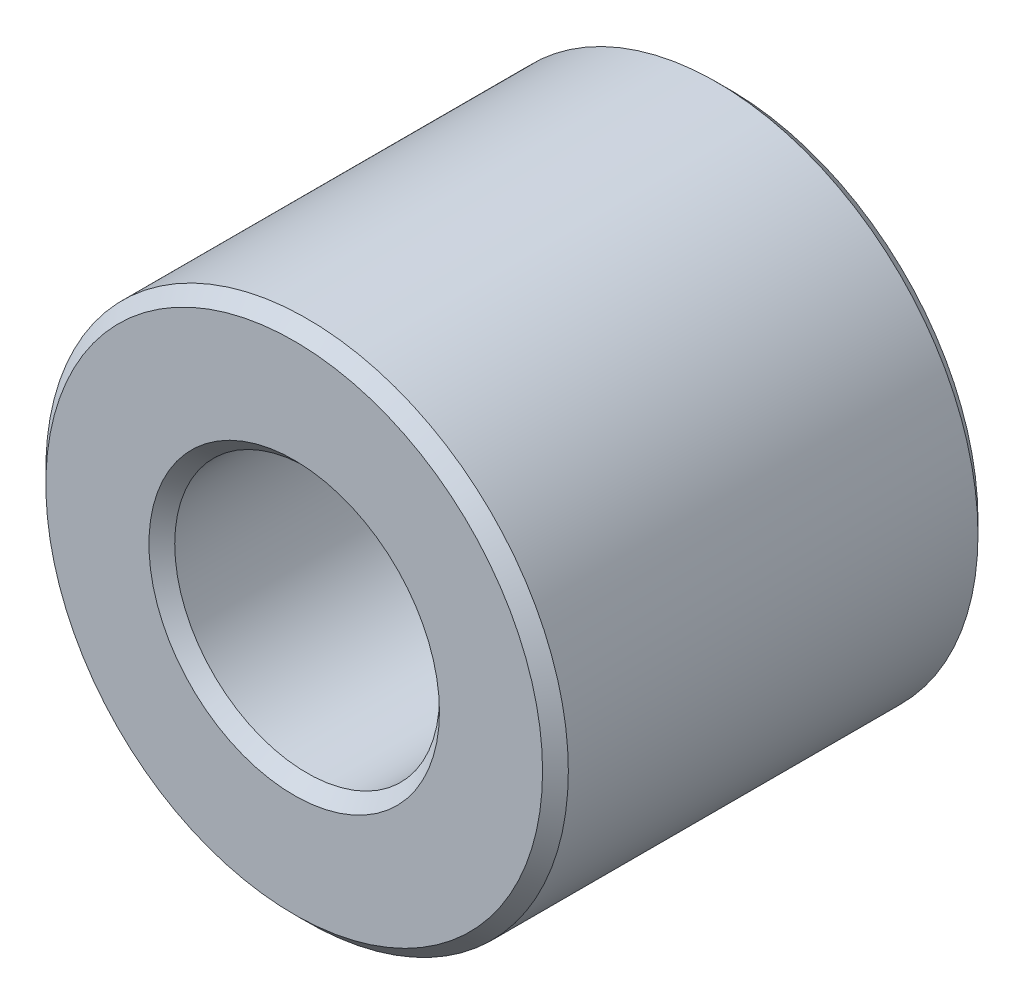
ISO-10303-21;
HEADER;
FILE_DESCRIPTION(('STEP AP214'),'2;1');
FILE_NAME('part.step','',(''),(''),'','','');
FILE_SCHEMA(('AUTOMOTIVE_DESIGN { 1 0 10303 214 1 1 1 1 }'));
ENDSEC;
DATA;
#1=APPLICATION_CONTEXT('core data for automotive mechanical design processes');
#2=APPLICATION_PROTOCOL_DEFINITION('international standard','automotive_design',2000,#1);
#3=PRODUCT_CONTEXT('',#1,'mechanical');
#4=PRODUCT('Part','Part','',(#3));
#5=PRODUCT_RELATED_PRODUCT_CATEGORY('part','',(#4));
#6=PRODUCT_DEFINITION_FORMATION('','',#4);
#7=PRODUCT_DEFINITION_CONTEXT('part definition',#1,'design');
#8=PRODUCT_DEFINITION('design','',#6,#7);
#9=PRODUCT_DEFINITION_SHAPE('','',#8);
#10=(LENGTH_UNIT() NAMED_UNIT(*) SI_UNIT(.MILLI.,.METRE.));
#11=(NAMED_UNIT(*) PLANE_ANGLE_UNIT() SI_UNIT($,.RADIAN.));
#12=(NAMED_UNIT(*) SI_UNIT($,.STERADIAN.) SOLID_ANGLE_UNIT());
#13=UNCERTAINTY_MEASURE_WITH_UNIT(LENGTH_MEASURE(1.E-05),#10,'distance_accuracy_value','');
#14=(GEOMETRIC_REPRESENTATION_CONTEXT(3) GLOBAL_UNCERTAINTY_ASSIGNED_CONTEXT((#13)) GLOBAL_UNIT_ASSIGNED_CONTEXT((#10,
#11,#12)) REPRESENTATION_CONTEXT('',''));
#15=CARTESIAN_POINT('',(0.,0.,0.));
#16=DIRECTION('',(0.,0.,1.));
#17=DIRECTION('',(1.,0.,0.));
#18=AXIS2_PLACEMENT_3D('',#15,#16,#17);
#19=CARTESIAN_POINT('',(0.,0.,-7.9375));
#20=DIRECTION('',(0.,0.,1.));
#21=DIRECTION('',(1.,0.,0.));
#22=AXIS2_PLACEMENT_3D('',#19,#20,#21);
#23=CYLINDRICAL_SURFACE('',#22,9.525);
#24=CARTESIAN_POINT('',(0.,0.,7.4676));
#25=DIRECTION('',(0.,0.,1.));
#26=DIRECTION('',(1.,0.,0.));
#27=AXIS2_PLACEMENT_3D('',#24,#25,#26);
#28=CIRCLE('',#27,9.525);
#29=CARTESIAN_POINT('',(9.525,0.,7.4676));
#30=VERTEX_POINT('',#29);
#31=EDGE_CURVE('E50',#30,#30,#28,.F.);
#32=ORIENTED_EDGE('',*,*,#31,.T.);
#33=EDGE_LOOP('',(#32));
#34=FACE_BOUND('',#33,.T.);
#35=CARTESIAN_POINT('',(0.,0.,-7.46759999999999));
#36=DIRECTION('',(0.,0.,1.));
#37=DIRECTION('',(1.,0.,0.));
#38=AXIS2_PLACEMENT_3D('',#35,#36,#37);
#39=CIRCLE('',#38,9.525);
#40=CARTESIAN_POINT('',(9.525,0.,-7.46759999999999));
#41=VERTEX_POINT('',#40);
#42=EDGE_CURVE('E53',#41,#41,#39,.T.);
#43=ORIENTED_EDGE('',*,*,#42,.T.);
#44=EDGE_LOOP('',(#43));
#45=FACE_BOUND('',#44,.T.);
#46=ADVANCED_FACE('F30',(#34,#45),#23,.T.);
#47=CARTESIAN_POINT('',(0.,0.,-7.9375));
#48=DIRECTION('',(0.,0.,1.));
#49=DIRECTION('',(1.,0.,0.));
#50=AXIS2_PLACEMENT_3D('',#47,#48,#49);
#51=PLANE('',#50);
#52=CARTESIAN_POINT('',(0.,0.,-7.9375));
#53=DIRECTION('',(0.,0.,1.));
#54=DIRECTION('',(1.,0.,0.));
#55=AXIS2_PLACEMENT_3D('',#52,#53,#54);
#56=CIRCLE('',#55,9.05509999999999);
#57=CARTESIAN_POINT('',(9.05509999999999,0.,-7.9375));
#58=VERTEX_POINT('',#57);
#59=EDGE_CURVE('E41',#58,#58,#56,.F.);
#60=ORIENTED_EDGE('',*,*,#59,.T.);
#61=EDGE_LOOP('',(#60));
#62=FACE_BOUND('',#61,.T.);
#63=CARTESIAN_POINT('',(0.,0.,-7.9375));
#64=DIRECTION('',(0.,0.,1.));
#65=DIRECTION('',(1.,0.,0.));
#66=AXIS2_PLACEMENT_3D('',#63,#64,#65);
#67=CIRCLE('',#66,5.2959);
#68=CARTESIAN_POINT('',(5.2959,0.,-7.9375));
#69=VERTEX_POINT('',#68);
#70=EDGE_CURVE('E45',#69,#69,#67,.T.);
#71=ORIENTED_EDGE('',*,*,#70,.T.);
#72=EDGE_LOOP('',(#71));
#73=FACE_BOUND('',#72,.T.);
#74=ADVANCED_FACE('F78',(#62,#73),#51,.F.);
#75=CARTESIAN_POINT('',(0.,0.,-7.9375));
#76=DIRECTION('',(0.,0.,1.));
#77=DIRECTION('',(1.,0.,0.));
#78=AXIS2_PLACEMENT_3D('',#75,#76,#77);
#79=CYLINDRICAL_SURFACE('',#78,4.826);
#80=CARTESIAN_POINT('',(0.,0.,7.46760000000001));
#81=DIRECTION('',(0.,0.,1.));
#82=DIRECTION('',(1.,0.,0.));
#83=AXIS2_PLACEMENT_3D('',#80,#81,#82);
#84=CIRCLE('',#83,4.826);
#85=CARTESIAN_POINT('',(4.826,0.,7.46760000000001));
#86=VERTEX_POINT('',#85);
#87=EDGE_CURVE('E10',#86,#86,#84,.T.);
#88=ORIENTED_EDGE('',*,*,#87,.T.);
#89=EDGE_LOOP('',(#88));
#90=FACE_BOUND('',#89,.T.);
#91=CARTESIAN_POINT('',(0.,0.,-7.4676));
#92=DIRECTION('',(0.,0.,1.));
#93=DIRECTION('',(1.,0.,0.));
#94=AXIS2_PLACEMENT_3D('',#91,#92,#93);
#95=CIRCLE('',#94,4.826);
#96=CARTESIAN_POINT('',(4.826,0.,-7.4676));
#97=VERTEX_POINT('',#96);
#98=EDGE_CURVE('E37',#97,#97,#95,.F.);
#99=ORIENTED_EDGE('',*,*,#98,.T.);
#100=EDGE_LOOP('',(#99));
#101=FACE_BOUND('',#100,.T.);
#102=ADVANCED_FACE('F84',(#90,#101),#79,.F.);
#103=CARTESIAN_POINT('',(0.,0.,7.9375));
#104=DIRECTION('',(0.,0.,1.));
#105=DIRECTION('',(1.,0.,0.));
#106=AXIS2_PLACEMENT_3D('',#103,#104,#105);
#107=PLANE('',#106);
#108=CARTESIAN_POINT('',(0.,0.,7.9375));
#109=DIRECTION('',(0.,0.,1.));
#110=DIRECTION('',(1.,0.,0.));
#111=AXIS2_PLACEMENT_3D('',#108,#109,#110);
#112=CIRCLE('',#111,9.0551);
#113=CARTESIAN_POINT('',(9.0551,0.,7.9375));
#114=VERTEX_POINT('',#113);
#115=EDGE_CURVE('E56',#114,#114,#112,.T.);
#116=ORIENTED_EDGE('',*,*,#115,.T.);
#117=EDGE_LOOP('',(#116));
#118=FACE_BOUND('',#117,.T.);
#119=CARTESIAN_POINT('',(0.,0.,7.9375));
#120=DIRECTION('',(0.,0.,1.));
#121=DIRECTION('',(1.,0.,0.));
#122=AXIS2_PLACEMENT_3D('',#119,#120,#121);
#123=CIRCLE('',#122,5.2959);
#124=CARTESIAN_POINT('',(5.2959,0.,7.9375));
#125=VERTEX_POINT('',#124);
#126=EDGE_CURVE('E59',#125,#125,#123,.F.);
#127=ORIENTED_EDGE('',*,*,#126,.T.);
#128=EDGE_LOOP('',(#127));
#129=FACE_BOUND('',#128,.T.);
#130=ADVANCED_FACE('F63',(#118,#129),#107,.T.);
#131=CARTESIAN_POINT('',(0.,0.,7.9375));
#132=DIRECTION('',(0.,0.,-1.));
#133=DIRECTION('',(-1.,0.,0.));
#134=AXIS2_PLACEMENT_3D('',#131,#132,#133);
#135=CONICAL_SURFACE('',#134,9.0551,0.785398163397454);
#136=ORIENTED_EDGE('',*,*,#31,.F.);
#137=EDGE_LOOP('',(#136));
#138=FACE_BOUND('',#137,.T.);
#139=ORIENTED_EDGE('',*,*,#115,.F.);
#140=EDGE_LOOP('',(#139));
#141=FACE_BOUND('',#140,.T.);
#142=ADVANCED_FACE('F74',(#138,#141),#135,.T.);
#143=CARTESIAN_POINT('',(0.,0.,-7.46759999999999));
#144=DIRECTION('',(0.,0.,1.));
#145=DIRECTION('',(1.,0.,0.));
#146=AXIS2_PLACEMENT_3D('',#143,#144,#145);
#147=CONICAL_SURFACE('',#146,9.525,0.785398163397448);
#148=ORIENTED_EDGE('',*,*,#59,.F.);
#149=EDGE_LOOP('',(#148));
#150=FACE_BOUND('',#149,.T.);
#151=ORIENTED_EDGE('',*,*,#42,.F.);
#152=EDGE_LOOP('',(#151));
#153=FACE_BOUND('',#152,.T.);
#154=ADVANCED_FACE('F68',(#150,#153),#147,.T.);
#155=CARTESIAN_POINT('',(0.,0.,7.46760000000001));
#156=DIRECTION('',(0.,0.,1.));
#157=DIRECTION('',(1.,0.,0.));
#158=AXIS2_PLACEMENT_3D('',#155,#156,#157);
#159=CONICAL_SURFACE('',#158,4.826,0.785398163397453);
#160=ORIENTED_EDGE('',*,*,#126,.F.);
#161=EDGE_LOOP('',(#160));
#162=FACE_BOUND('',#161,.T.);
#163=ORIENTED_EDGE('',*,*,#87,.F.);
#164=EDGE_LOOP('',(#163));
#165=FACE_BOUND('',#164,.T.);
#166=ADVANCED_FACE('F65',(#162,#165),#159,.F.);
#167=CARTESIAN_POINT('',(0.,0.,-7.9375));
#168=DIRECTION('',(0.,0.,-1.));
#169=DIRECTION('',(-1.,0.,0.));
#170=AXIS2_PLACEMENT_3D('',#167,#168,#169);
#171=CONICAL_SURFACE('',#170,5.2959,0.785398163397451);
#172=ORIENTED_EDGE('',*,*,#98,.F.);
#173=EDGE_LOOP('',(#172));
#174=FACE_BOUND('',#173,.T.);
#175=ORIENTED_EDGE('',*,*,#70,.F.);
#176=EDGE_LOOP('',(#175));
#177=FACE_BOUND('',#176,.T.);
#178=ADVANCED_FACE('F32',(#174,#177),#171,.F.);
#179=CLOSED_SHELL('',(#46,#74,#102,#130,#142,#154,#166,#178));
#180=MANIFOLD_SOLID_BREP('B2',#179);
#181=ADVANCED_BREP_SHAPE_REPRESENTATION('',(#18,#180),#14);
#182=SHAPE_DEFINITION_REPRESENTATION(#9,#181);
ENDSEC;
END-ISO-10303-21;
